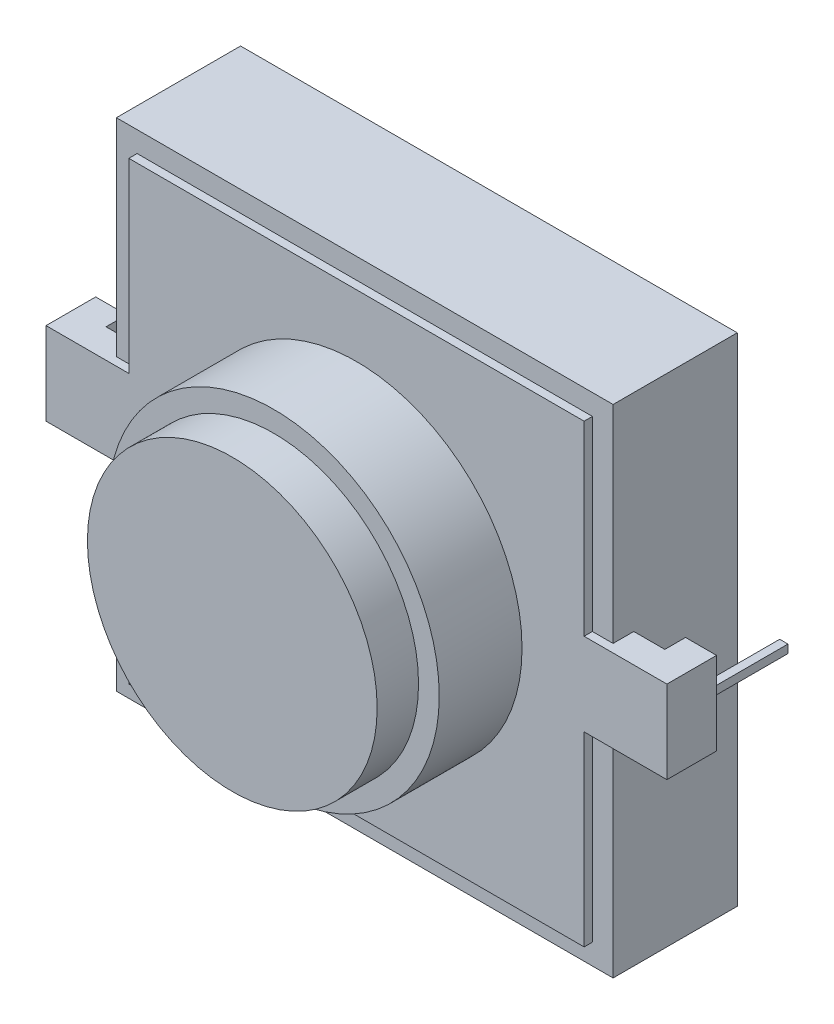
ISO-10303-21;
HEADER;
FILE_DESCRIPTION(('STEP AP214'),'2;1');
FILE_NAME('part.step','',(''),(''),'','','');
FILE_SCHEMA(('AUTOMOTIVE_DESIGN { 1 0 10303 214 1 1 1 1 }'));
ENDSEC;
DATA;
#1=APPLICATION_CONTEXT('core data for automotive mechanical design processes');
#2=APPLICATION_PROTOCOL_DEFINITION('international standard','automotive_design',2000,#1);
#3=PRODUCT_CONTEXT('',#1,'mechanical');
#4=PRODUCT('Part','Part','',(#3));
#5=PRODUCT_RELATED_PRODUCT_CATEGORY('part','',(#4));
#6=PRODUCT_DEFINITION_FORMATION('','',#4);
#7=PRODUCT_DEFINITION_CONTEXT('part definition',#1,'design');
#8=PRODUCT_DEFINITION('design','',#6,#7);
#9=PRODUCT_DEFINITION_SHAPE('','',#8);
#10=(LENGTH_UNIT() NAMED_UNIT(*) SI_UNIT(.MILLI.,.METRE.));
#11=(NAMED_UNIT(*) PLANE_ANGLE_UNIT() SI_UNIT($,.RADIAN.));
#12=(NAMED_UNIT(*) SI_UNIT($,.STERADIAN.) SOLID_ANGLE_UNIT());
#13=UNCERTAINTY_MEASURE_WITH_UNIT(LENGTH_MEASURE(1.E-05),#10,'distance_accuracy_value','');
#14=(GEOMETRIC_REPRESENTATION_CONTEXT(3) GLOBAL_UNCERTAINTY_ASSIGNED_CONTEXT((#13)) GLOBAL_UNIT_ASSIGNED_CONTEXT((#10,
#11,#12)) REPRESENTATION_CONTEXT('',''));
#15=CARTESIAN_POINT('',(0.,0.,0.));
#16=DIRECTION('',(0.,0.,1.));
#17=DIRECTION('',(1.,0.,0.));
#18=AXIS2_PLACEMENT_3D('',#15,#16,#17);
#19=CARTESIAN_POINT('',(-6.75,1.,2.));
#20=DIRECTION('',(0.,0.,1.));
#21=DIRECTION('',(1.,0.,0.));
#22=AXIS2_PLACEMENT_3D('',#19,#20,#21);
#23=PLANE('',#22);
#24=DIRECTION('',(-1.,0.,0.));
#25=VECTOR('',#24,1.);
#26=CARTESIAN_POINT('',(-6.75,-1.,2.));
#27=LINE('',#26,#25);
#28=CARTESIAN_POINT('',(-6.75,-1.,2.));
#29=VERTEX_POINT('',#28);
#30=CARTESIAN_POINT('',(-7.5,-1.,2.));
#31=VERTEX_POINT('',#30);
#32=EDGE_CURVE('E314',#29,#31,#27,.T.);
#33=ORIENTED_EDGE('',*,*,#32,.T.);
#34=DIRECTION('',(0.,-1.,0.));
#35=VECTOR('',#34,1.);
#36=CARTESIAN_POINT('',(-7.5,1.,2.));
#37=LINE('',#36,#35);
#38=CARTESIAN_POINT('',(-7.5,1.,2.));
#39=VERTEX_POINT('',#38);
#40=EDGE_CURVE('E321',#39,#31,#37,.T.);
#41=ORIENTED_EDGE('',*,*,#40,.F.);
#42=DIRECTION('',(-1.,0.,0.));
#43=VECTOR('',#42,1.);
#44=CARTESIAN_POINT('',(-6.75,1.,2.));
#45=LINE('',#44,#43);
#46=CARTESIAN_POINT('',(-6.75,1.,2.));
#47=VERTEX_POINT('',#46);
#48=EDGE_CURVE('E318',#47,#39,#45,.T.);
#49=ORIENTED_EDGE('',*,*,#48,.F.);
#50=DIRECTION('',(0.,-1.,0.));
#51=VECTOR('',#50,1.);
#52=CARTESIAN_POINT('',(-6.75,1.,2.));
#53=LINE('',#52,#51);
#54=EDGE_CURVE('E332',#47,#29,#53,.T.);
#55=ORIENTED_EDGE('',*,*,#54,.T.);
#56=EDGE_LOOP('',(#33,#41,#49,#55));
#57=FACE_BOUND('',#56,.T.);
#58=DIRECTION('',(1.,0.,0.));
#59=VECTOR('',#58,1.);
#60=CARTESIAN_POINT('',(-7.225,0.1,2.));
#61=LINE('',#60,#59);
#62=CARTESIAN_POINT('',(-7.225,0.1,2.));
#63=VERTEX_POINT('',#62);
#64=CARTESIAN_POINT('',(-7.025,0.1,2.));
#65=VERTEX_POINT('',#64);
#66=EDGE_CURVE('E246',#63,#65,#61,.T.);
#67=ORIENTED_EDGE('',*,*,#66,.F.);
#68=DIRECTION('',(0.,-1.,0.));
#69=VECTOR('',#68,1.);
#70=CARTESIAN_POINT('',(-7.225,0.1,2.));
#71=LINE('',#70,#69);
#72=CARTESIAN_POINT('',(-7.225,-0.1,2.));
#73=VERTEX_POINT('',#72);
#74=EDGE_CURVE('E257',#63,#73,#71,.T.);
#75=ORIENTED_EDGE('',*,*,#74,.T.);
#76=DIRECTION('',(1.,0.,0.));
#77=VECTOR('',#76,1.);
#78=CARTESIAN_POINT('',(-7.225,-0.1,2.));
#79=LINE('',#78,#77);
#80=CARTESIAN_POINT('',(-7.025,-0.1,2.));
#81=VERTEX_POINT('',#80);
#82=EDGE_CURVE('E274',#73,#81,#79,.T.);
#83=ORIENTED_EDGE('',*,*,#82,.T.);
#84=DIRECTION('',(0.,-1.,0.));
#85=VECTOR('',#84,1.);
#86=CARTESIAN_POINT('',(-7.025,0.1,2.));
#87=LINE('',#86,#85);
#88=EDGE_CURVE('E264',#65,#81,#87,.T.);
#89=ORIENTED_EDGE('',*,*,#88,.F.);
#90=EDGE_LOOP('',(#67,#75,#83,#89));
#91=FACE_BOUND('',#90,.T.);
#92=ADVANCED_FACE('F32',(#57,#91),#23,.F.);
#93=CARTESIAN_POINT('',(6.,6.,3.));
#94=DIRECTION('',(-1.,0.,0.));
#95=DIRECTION('',(0.,-1.,0.));
#96=AXIS2_PLACEMENT_3D('',#93,#94,#95);
#97=PLANE('',#96);
#98=DIRECTION('',(0.,0.,1.));
#99=VECTOR('',#98,1.);
#100=CARTESIAN_POINT('',(6.,1.,3.));
#101=LINE('',#100,#99);
#102=CARTESIAN_POINT('',(6.,1.,2.5));
#103=VERTEX_POINT('',#102);
#104=CARTESIAN_POINT('',(6.,1.,3.));
#105=VERTEX_POINT('',#104);
#106=EDGE_CURVE('E348',#103,#105,#101,.T.);
#107=ORIENTED_EDGE('',*,*,#106,.F.);
#108=DIRECTION('',(0.,-1.,0.));
#109=VECTOR('',#108,1.);
#110=CARTESIAN_POINT('',(6.,1.,2.5));
#111=LINE('',#110,#109);
#112=CARTESIAN_POINT('',(6.,-1.,2.5));
#113=VERTEX_POINT('',#112);
#114=EDGE_CURVE('E350',#103,#113,#111,.T.);
#115=ORIENTED_EDGE('',*,*,#114,.T.);
#116=DIRECTION('',(0.,0.,1.));
#117=VECTOR('',#116,1.);
#118=CARTESIAN_POINT('',(6.,-1.,3.));
#119=LINE('',#118,#117);
#120=CARTESIAN_POINT('',(6.,-1.,3.));
#121=VERTEX_POINT('',#120);
#122=EDGE_CURVE('E344',#113,#121,#119,.T.);
#123=ORIENTED_EDGE('',*,*,#122,.T.);
#124=DIRECTION('',(0.,1.,0.));
#125=VECTOR('',#124,1.);
#126=CARTESIAN_POINT('',(6.,6.,3.));
#127=LINE('',#126,#125);
#128=CARTESIAN_POINT('',(6.,-6.,3.));
#129=VERTEX_POINT('',#128);
#130=EDGE_CURVE('E455',#129,#121,#127,.T.);
#131=ORIENTED_EDGE('',*,*,#130,.F.);
#132=DIRECTION('',(0.,0.,-1.));
#133=VECTOR('',#132,1.);
#134=CARTESIAN_POINT('',(6.,-6.,3.));
#135=LINE('',#134,#133);
#136=CARTESIAN_POINT('',(6.,-6.,0.));
#137=VERTEX_POINT('',#136);
#138=EDGE_CURVE('E467',#129,#137,#135,.T.);
#139=ORIENTED_EDGE('',*,*,#138,.T.);
#140=DIRECTION('',(0.,1.,0.));
#141=VECTOR('',#140,1.);
#142=CARTESIAN_POINT('',(6.,6.,0.));
#143=LINE('',#142,#141);
#144=CARTESIAN_POINT('',(6.,6.,0.));
#145=VERTEX_POINT('',#144);
#146=EDGE_CURVE('E454',#137,#145,#143,.T.);
#147=ORIENTED_EDGE('',*,*,#146,.T.);
#148=DIRECTION('',(0.,0.,-1.));
#149=VECTOR('',#148,1.);
#150=CARTESIAN_POINT('',(6.,6.,3.));
#151=LINE('',#150,#149);
#152=CARTESIAN_POINT('',(6.,6.,3.));
#153=VERTEX_POINT('',#152);
#154=EDGE_CURVE('E36',#153,#145,#151,.T.);
#155=ORIENTED_EDGE('',*,*,#154,.F.);
#156=EDGE_CURVE('E459',#105,#153,#127,.T.);
#157=ORIENTED_EDGE('',*,*,#156,.F.);
#158=EDGE_LOOP('',(#107,#115,#123,#131,#139,#147,#155,#157));
#159=FACE_BOUND('',#158,.T.);
#160=ADVANCED_FACE('F34',(#159),#97,.F.);
#161=CARTESIAN_POINT('',(0.,0.,3.));
#162=DIRECTION('',(0.,0.,1.));
#163=DIRECTION('',(1.,0.,0.));
#164=AXIS2_PLACEMENT_3D('',#161,#162,#163);
#165=PLANE('',#164);
#166=DIRECTION('',(1.,0.,0.));
#167=VECTOR('',#166,1.);
#168=CARTESIAN_POINT('',(5.5,-1.,3.));
#169=LINE('',#168,#167);
#170=CARTESIAN_POINT('',(5.5,-1.,3.));
#171=VERTEX_POINT('',#170);
#172=EDGE_CURVE('E416',#171,#121,#169,.T.);
#173=ORIENTED_EDGE('',*,*,#172,.F.);
#174=DIRECTION('',(0.,1.,0.));
#175=VECTOR('',#174,1.);
#176=CARTESIAN_POINT('',(5.5,-1.,3.));
#177=LINE('',#176,#175);
#178=CARTESIAN_POINT('',(5.50000000000001,-5.5,3.));
#179=VERTEX_POINT('',#178);
#180=EDGE_CURVE('E413',#179,#171,#177,.T.);
#181=ORIENTED_EDGE('',*,*,#180,.F.);
#182=DIRECTION('',(1.,0.,0.));
#183=VECTOR('',#182,1.);
#184=CARTESIAN_POINT('',(-5.5,-5.5,3.));
#185=LINE('',#184,#183);
#186=CARTESIAN_POINT('',(-5.5,-5.5,3.));
#187=VERTEX_POINT('',#186);
#188=EDGE_CURVE('E410',#187,#179,#185,.T.);
#189=ORIENTED_EDGE('',*,*,#188,.F.);
#190=DIRECTION('',(0.,-1.,0.));
#191=VECTOR('',#190,1.);
#192=CARTESIAN_POINT('',(-5.5,-5.5,3.));
#193=LINE('',#192,#191);
#194=CARTESIAN_POINT('',(-5.5,-1.,3.));
#195=VERTEX_POINT('',#194);
#196=EDGE_CURVE('E404',#195,#187,#193,.T.);
#197=ORIENTED_EDGE('',*,*,#196,.F.);
#198=DIRECTION('',(1.,0.,0.));
#199=VECTOR('',#198,1.);
#200=CARTESIAN_POINT('',(-5.5,-1.,3.));
#201=LINE('',#200,#199);
#202=CARTESIAN_POINT('',(-6.,-1.,3.));
#203=VERTEX_POINT('',#202);
#204=EDGE_CURVE('E41',#203,#195,#201,.T.);
#205=ORIENTED_EDGE('',*,*,#204,.F.);
#206=DIRECTION('',(0.,-1.,0.));
#207=VECTOR('',#206,1.);
#208=CARTESIAN_POINT('',(-6.,6.,3.));
#209=LINE('',#208,#207);
#210=CARTESIAN_POINT('',(-6.,-6.,3.));
#211=VERTEX_POINT('',#210);
#212=EDGE_CURVE('E461',#203,#211,#209,.T.);
#213=ORIENTED_EDGE('',*,*,#212,.T.);
#214=DIRECTION('',(1.,0.,0.));
#215=VECTOR('',#214,1.);
#216=CARTESIAN_POINT('',(-6.,-6.,3.));
#217=LINE('',#216,#215);
#218=EDGE_CURVE('E465',#211,#129,#217,.T.);
#219=ORIENTED_EDGE('',*,*,#218,.T.);
#220=ORIENTED_EDGE('',*,*,#130,.T.);
#221=EDGE_LOOP('',(#173,#181,#189,#197,#205,#213,#219,#220));
#222=FACE_BOUND('',#221,.T.);
#223=ADVANCED_FACE('F508',(#222),#165,.T.);
#224=CARTESIAN_POINT('',(-6.,6.,3.));
#225=DIRECTION('',(0.,-1.,0.));
#226=DIRECTION('',(0.,0.,-1.));
#227=AXIS2_PLACEMENT_3D('',#224,#225,#226);
#228=PLANE('',#227);
#229=DIRECTION('',(-1.,0.,0.));
#230=VECTOR('',#229,1.);
#231=CARTESIAN_POINT('',(-6.,6.,0.));
#232=LINE('',#231,#230);
#233=CARTESIAN_POINT('',(-6.,6.,0.));
#234=VERTEX_POINT('',#233);
#235=EDGE_CURVE('E470',#145,#234,#232,.T.);
#236=ORIENTED_EDGE('',*,*,#235,.T.);
#237=DIRECTION('',(0.,0.,-1.));
#238=VECTOR('',#237,1.);
#239=CARTESIAN_POINT('',(-6.,6.,3.));
#240=LINE('',#239,#238);
#241=CARTESIAN_POINT('',(-6.,6.,3.));
#242=VERTEX_POINT('',#241);
#243=EDGE_CURVE('E480',#242,#234,#240,.T.);
#244=ORIENTED_EDGE('',*,*,#243,.F.);
#245=DIRECTION('',(-1.,0.,0.));
#246=VECTOR('',#245,1.);
#247=CARTESIAN_POINT('',(-6.,6.,3.));
#248=LINE('',#247,#246);
#249=EDGE_CURVE('E458',#153,#242,#248,.T.);
#250=ORIENTED_EDGE('',*,*,#249,.F.);
#251=ORIENTED_EDGE('',*,*,#154,.T.);
#252=EDGE_LOOP('',(#236,#244,#250,#251));
#253=FACE_BOUND('',#252,.T.);
#254=ADVANCED_FACE('F490',(#253),#228,.F.);
#255=CARTESIAN_POINT('',(-6.,6.,3.));
#256=DIRECTION('',(1.,0.,0.));
#257=DIRECTION('',(0.,1.,0.));
#258=AXIS2_PLACEMENT_3D('',#255,#256,#257);
#259=PLANE('',#258);
#260=DIRECTION('',(0.,-1.,0.));
#261=VECTOR('',#260,1.);
#262=CARTESIAN_POINT('',(-6.,1.,2.5));
#263=LINE('',#262,#261);
#264=CARTESIAN_POINT('',(-6.,1.,2.5));
#265=VERTEX_POINT('',#264);
#266=CARTESIAN_POINT('',(-6.,-1.,2.5));
#267=VERTEX_POINT('',#266);
#268=EDGE_CURVE('E338',#265,#267,#263,.T.);
#269=ORIENTED_EDGE('',*,*,#268,.F.);
#270=DIRECTION('',(0.,0.,-1.));
#271=VECTOR('',#270,1.);
#272=CARTESIAN_POINT('',(-6.,1.,3.));
#273=LINE('',#272,#271);
#274=CARTESIAN_POINT('',(-6.,1.,3.));
#275=VERTEX_POINT('',#274);
#276=EDGE_CURVE('E311',#275,#265,#273,.T.);
#277=ORIENTED_EDGE('',*,*,#276,.F.);
#278=EDGE_CURVE('E462',#242,#275,#209,.T.);
#279=ORIENTED_EDGE('',*,*,#278,.F.);
#280=ORIENTED_EDGE('',*,*,#243,.T.);
#281=DIRECTION('',(0.,-1.,0.));
#282=VECTOR('',#281,1.);
#283=CARTESIAN_POINT('',(-6.,6.,0.));
#284=LINE('',#283,#282);
#285=CARTESIAN_POINT('',(-6.,-6.,0.));
#286=VERTEX_POINT('',#285);
#287=EDGE_CURVE('E472',#234,#286,#284,.T.);
#288=ORIENTED_EDGE('',*,*,#287,.T.);
#289=DIRECTION('',(0.,0.,-1.));
#290=VECTOR('',#289,1.);
#291=CARTESIAN_POINT('',(-6.,-6.,3.));
#292=LINE('',#291,#290);
#293=EDGE_CURVE('E478',#211,#286,#292,.T.);
#294=ORIENTED_EDGE('',*,*,#293,.F.);
#295=ORIENTED_EDGE('',*,*,#212,.F.);
#296=DIRECTION('',(0.,0.,-1.));
#297=VECTOR('',#296,1.);
#298=CARTESIAN_POINT('',(-6.,-1.,3.));
#299=LINE('',#298,#297);
#300=EDGE_CURVE('E310',#203,#267,#299,.T.);
#301=ORIENTED_EDGE('',*,*,#300,.T.);
#302=EDGE_LOOP('',(#269,#277,#279,#280,#288,#294,#295,#301));
#303=FACE_BOUND('',#302,.T.);
#304=ADVANCED_FACE('F502',(#303),#259,.F.);
#305=CARTESIAN_POINT('',(-6.,-6.,3.));
#306=DIRECTION('',(0.,1.,0.));
#307=DIRECTION('',(0.,0.,1.));
#308=AXIS2_PLACEMENT_3D('',#305,#306,#307);
#309=PLANE('',#308);
#310=DIRECTION('',(1.,0.,0.));
#311=VECTOR('',#310,1.);
#312=CARTESIAN_POINT('',(-6.,-6.,0.));
#313=LINE('',#312,#311);
#314=EDGE_CURVE('E474',#286,#137,#313,.T.);
#315=ORIENTED_EDGE('',*,*,#314,.T.);
#316=ORIENTED_EDGE('',*,*,#138,.F.);
#317=ORIENTED_EDGE('',*,*,#218,.F.);
#318=ORIENTED_EDGE('',*,*,#293,.T.);
#319=EDGE_LOOP('',(#315,#316,#317,#318));
#320=FACE_BOUND('',#319,.T.);
#321=ADVANCED_FACE('F506',(#320),#309,.F.);
#322=DIRECTION('',(-1.,0.,0.));
#323=VECTOR('',#322,1.);
#324=CARTESIAN_POINT('',(5.5,1.,3.));
#325=LINE('',#324,#323);
#326=CARTESIAN_POINT('',(5.5,1.,3.));
#327=VERTEX_POINT('',#326);
#328=EDGE_CURVE('E407',#105,#327,#325,.T.);
#329=ORIENTED_EDGE('',*,*,#328,.F.);
#330=ORIENTED_EDGE('',*,*,#156,.T.);
#331=ORIENTED_EDGE('',*,*,#249,.T.);
#332=ORIENTED_EDGE('',*,*,#278,.T.);
#333=DIRECTION('',(-1.,0.,0.));
#334=VECTOR('',#333,1.);
#335=CARTESIAN_POINT('',(-5.5,1.,3.));
#336=LINE('',#335,#334);
#337=CARTESIAN_POINT('',(-5.5,1.,3.));
#338=VERTEX_POINT('',#337);
#339=EDGE_CURVE('E401',#338,#275,#336,.T.);
#340=ORIENTED_EDGE('',*,*,#339,.F.);
#341=DIRECTION('',(0.,-1.,0.));
#342=VECTOR('',#341,1.);
#343=CARTESIAN_POINT('',(-5.5,1.,3.));
#344=LINE('',#343,#342);
#345=CARTESIAN_POINT('',(-5.5,5.5,3.));
#346=VERTEX_POINT('',#345);
#347=EDGE_CURVE('E398',#346,#338,#344,.T.);
#348=ORIENTED_EDGE('',*,*,#347,.F.);
#349=DIRECTION('',(-1.,0.,0.));
#350=VECTOR('',#349,1.);
#351=CARTESIAN_POINT('',(-5.5,5.5,3.));
#352=LINE('',#351,#350);
#353=CARTESIAN_POINT('',(5.5,5.5,3.));
#354=VERTEX_POINT('',#353);
#355=EDGE_CURVE('E368',#354,#346,#352,.T.);
#356=ORIENTED_EDGE('',*,*,#355,.F.);
#357=DIRECTION('',(0.,1.,0.));
#358=VECTOR('',#357,1.);
#359=CARTESIAN_POINT('',(5.5,5.5,3.));
#360=LINE('',#359,#358);
#361=EDGE_CURVE('E373',#327,#354,#360,.T.);
#362=ORIENTED_EDGE('',*,*,#361,.F.);
#363=EDGE_LOOP('',(#329,#330,#331,#332,#340,#348,#356,#362));
#364=FACE_BOUND('',#363,.T.);
#365=ADVANCED_FACE('F531',(#364),#165,.T.);
#366=CARTESIAN_POINT('',(0.,0.,0.));
#367=DIRECTION('',(0.,0.,1.));
#368=DIRECTION('',(1.,0.,0.));
#369=AXIS2_PLACEMENT_3D('',#366,#367,#368);
#370=PLANE('',#369);
#371=ORIENTED_EDGE('',*,*,#146,.F.);
#372=ORIENTED_EDGE('',*,*,#314,.F.);
#373=ORIENTED_EDGE('',*,*,#287,.F.);
#374=ORIENTED_EDGE('',*,*,#235,.F.);
#375=EDGE_LOOP('',(#371,#372,#373,#374));
#376=FACE_BOUND('',#375,.T.);
#377=ADVANCED_FACE('F499',(#376),#370,.F.);
#378=CARTESIAN_POINT('',(-5.5,5.5,3.2));
#379=DIRECTION('',(0.,-1.,0.));
#380=DIRECTION('',(1.,0.,0.));
#381=AXIS2_PLACEMENT_3D('',#378,#379,#380);
#382=PLANE('',#381);
#383=ORIENTED_EDGE('',*,*,#355,.T.);
#384=DIRECTION('',(0.,0.,-1.));
#385=VECTOR('',#384,1.);
#386=CARTESIAN_POINT('',(-5.5,5.5,3.2));
#387=LINE('',#386,#385);
#388=CARTESIAN_POINT('',(-5.5,5.5,3.2));
#389=VERTEX_POINT('',#388);
#390=EDGE_CURVE('E451',#389,#346,#387,.T.);
#391=ORIENTED_EDGE('',*,*,#390,.F.);
#392=DIRECTION('',(-1.,0.,0.));
#393=VECTOR('',#392,1.);
#394=CARTESIAN_POINT('',(-5.5,5.5,3.2));
#395=LINE('',#394,#393);
#396=CARTESIAN_POINT('',(5.5,5.5,3.2));
#397=VERTEX_POINT('',#396);
#398=EDGE_CURVE('E369',#397,#389,#395,.T.);
#399=ORIENTED_EDGE('',*,*,#398,.F.);
#400=DIRECTION('',(0.,0.,-1.));
#401=VECTOR('',#400,1.);
#402=CARTESIAN_POINT('',(5.5,5.5,3.2));
#403=LINE('',#402,#401);
#404=EDGE_CURVE('E395',#397,#354,#403,.T.);
#405=ORIENTED_EDGE('',*,*,#404,.T.);
#406=EDGE_LOOP('',(#383,#391,#399,#405));
#407=FACE_BOUND('',#406,.T.);
#408=ADVANCED_FACE('F620',(#407),#382,.F.);
#409=CARTESIAN_POINT('',(-5.5,1.,3.2));
#410=DIRECTION('',(1.,0.,0.));
#411=DIRECTION('',(0.,1.,0.));
#412=AXIS2_PLACEMENT_3D('',#409,#410,#411);
#413=PLANE('',#412);
#414=ORIENTED_EDGE('',*,*,#347,.T.);
#415=DIRECTION('',(0.,0.,-1.));
#416=VECTOR('',#415,1.);
#417=CARTESIAN_POINT('',(-5.5,1.,3.2));
#418=LINE('',#417,#416);
#419=CARTESIAN_POINT('',(-5.5,1.,3.2));
#420=VERTEX_POINT('',#419);
#421=EDGE_CURVE('E448',#420,#338,#418,.T.);
#422=ORIENTED_EDGE('',*,*,#421,.F.);
#423=DIRECTION('',(0.,-1.,0.));
#424=VECTOR('',#423,1.);
#425=CARTESIAN_POINT('',(-5.5,1.,3.2));
#426=LINE('',#425,#424);
#427=EDGE_CURVE('E372',#389,#420,#426,.T.);
#428=ORIENTED_EDGE('',*,*,#427,.F.);
#429=ORIENTED_EDGE('',*,*,#390,.T.);
#430=EDGE_LOOP('',(#414,#422,#428,#429));
#431=FACE_BOUND('',#430,.T.);
#432=ADVANCED_FACE('F617',(#431),#413,.F.);
#433=CARTESIAN_POINT('',(-5.5,1.,3.2));
#434=DIRECTION('',(0.,-1.,0.));
#435=DIRECTION('',(0.,0.,-1.));
#436=AXIS2_PLACEMENT_3D('',#433,#434,#435);
#437=PLANE('',#436);
#438=ORIENTED_EDGE('',*,*,#339,.T.);
#439=ORIENTED_EDGE('',*,*,#276,.T.);
#440=DIRECTION('',(-1.,0.,0.));
#441=VECTOR('',#440,1.);
#442=CARTESIAN_POINT('',(-6.,1.,2.5));
#443=LINE('',#442,#441);
#444=CARTESIAN_POINT('',(-6.75,1.,2.5));
#445=VERTEX_POINT('',#444);
#446=EDGE_CURVE('E313',#265,#445,#443,.T.);
#447=ORIENTED_EDGE('',*,*,#446,.T.);
#448=DIRECTION('',(0.,0.,-1.));
#449=VECTOR('',#448,1.);
#450=CARTESIAN_POINT('',(-6.75,1.,2.5));
#451=LINE('',#450,#449);
#452=EDGE_CURVE('E316',#445,#47,#451,.T.);
#453=ORIENTED_EDGE('',*,*,#452,.T.);
#454=ORIENTED_EDGE('',*,*,#48,.T.);
#455=DIRECTION('',(0.,0.,-1.));
#456=VECTOR('',#455,1.);
#457=CARTESIAN_POINT('',(-7.5,1.,3.2));
#458=LINE('',#457,#456);
#459=CARTESIAN_POINT('',(-7.5,1.,3.2));
#460=VERTEX_POINT('',#459);
#461=EDGE_CURVE('E446',#460,#39,#458,.T.);
#462=ORIENTED_EDGE('',*,*,#461,.F.);
#463=DIRECTION('',(-1.,0.,0.));
#464=VECTOR('',#463,1.);
#465=CARTESIAN_POINT('',(-5.5,1.,3.2));
#466=LINE('',#465,#464);
#467=EDGE_CURVE('E375',#420,#460,#466,.T.);
#468=ORIENTED_EDGE('',*,*,#467,.F.);
#469=ORIENTED_EDGE('',*,*,#421,.T.);
#470=EDGE_LOOP('',(#438,#439,#447,#453,#454,#462,#468,#469));
#471=FACE_BOUND('',#470,.T.);
#472=ADVANCED_FACE('F526',(#471),#437,.F.);
#473=CARTESIAN_POINT('',(-7.5,1.,3.2));
#474=DIRECTION('',(1.,0.,0.));
#475=DIRECTION('',(0.,0.,-1.));
#476=AXIS2_PLACEMENT_3D('',#473,#474,#475);
#477=PLANE('',#476);
#478=ORIENTED_EDGE('',*,*,#461,.T.);
#479=ORIENTED_EDGE('',*,*,#40,.T.);
#480=DIRECTION('',(0.,0.,-1.));
#481=VECTOR('',#480,1.);
#482=CARTESIAN_POINT('',(-7.5,-1.,3.2));
#483=LINE('',#482,#481);
#484=CARTESIAN_POINT('',(-7.5,-1.,3.2));
#485=VERTEX_POINT('',#484);
#486=EDGE_CURVE('E444',#485,#31,#483,.T.);
#487=ORIENTED_EDGE('',*,*,#486,.F.);
#488=DIRECTION('',(0.,-1.,0.));
#489=VECTOR('',#488,1.);
#490=CARTESIAN_POINT('',(-7.5,1.,3.2));
#491=LINE('',#490,#489);
#492=EDGE_CURVE('E377',#460,#485,#491,.T.);
#493=ORIENTED_EDGE('',*,*,#492,.F.);
#494=EDGE_LOOP('',(#478,#479,#487,#493));
#495=FACE_BOUND('',#494,.T.);
#496=ADVANCED_FACE('F566',(#495),#477,.F.);
#497=CARTESIAN_POINT('',(-5.5,-1.,3.2));
#498=DIRECTION('',(0.,1.,0.));
#499=DIRECTION('',(0.,0.,1.));
#500=AXIS2_PLACEMENT_3D('',#497,#498,#499);
#501=PLANE('',#500);
#502=ORIENTED_EDGE('',*,*,#486,.T.);
#503=ORIENTED_EDGE('',*,*,#32,.F.);
#504=DIRECTION('',(0.,0.,-1.));
#505=VECTOR('',#504,1.);
#506=CARTESIAN_POINT('',(-6.75,-1.,2.5));
#507=LINE('',#506,#505);
#508=CARTESIAN_POINT('',(-6.75,-1.,2.5));
#509=VERTEX_POINT('',#508);
#510=EDGE_CURVE('E326',#509,#29,#507,.T.);
#511=ORIENTED_EDGE('',*,*,#510,.F.);
#512=DIRECTION('',(-1.,0.,0.));
#513=VECTOR('',#512,1.);
#514=CARTESIAN_POINT('',(-6.,-1.,2.5));
#515=LINE('',#514,#513);
#516=EDGE_CURVE('E324',#267,#509,#515,.T.);
#517=ORIENTED_EDGE('',*,*,#516,.F.);
#518=ORIENTED_EDGE('',*,*,#300,.F.);
#519=ORIENTED_EDGE('',*,*,#204,.T.);
#520=DIRECTION('',(0.,0.,-1.));
#521=VECTOR('',#520,1.);
#522=CARTESIAN_POINT('',(-5.5,-1.,3.2));
#523=LINE('',#522,#521);
#524=CARTESIAN_POINT('',(-5.5,-1.,3.2));
#525=VERTEX_POINT('',#524);
#526=EDGE_CURVE('E441',#525,#195,#523,.T.);
#527=ORIENTED_EDGE('',*,*,#526,.F.);
#528=DIRECTION('',(1.,0.,0.));
#529=VECTOR('',#528,1.);
#530=CARTESIAN_POINT('',(-5.5,-1.,3.2));
#531=LINE('',#530,#529);
#532=EDGE_CURVE('E379',#485,#525,#531,.T.);
#533=ORIENTED_EDGE('',*,*,#532,.F.);
#534=EDGE_LOOP('',(#502,#503,#511,#517,#518,#519,#527,#533));
#535=FACE_BOUND('',#534,.T.);
#536=ADVANCED_FACE('F512',(#535),#501,.F.);
#537=CARTESIAN_POINT('',(-5.5,-5.5,3.2));
#538=DIRECTION('',(1.,0.,0.));
#539=DIRECTION('',(0.,1.,0.));
#540=AXIS2_PLACEMENT_3D('',#537,#538,#539);
#541=PLANE('',#540);
#542=ORIENTED_EDGE('',*,*,#196,.T.);
#543=DIRECTION('',(0.,0.,-1.));
#544=VECTOR('',#543,1.);
#545=CARTESIAN_POINT('',(-5.5,-5.5,3.2));
#546=LINE('',#545,#544);
#547=CARTESIAN_POINT('',(-5.5,-5.5,3.2));
#548=VERTEX_POINT('',#547);
#549=EDGE_CURVE('E438',#548,#187,#546,.T.);
#550=ORIENTED_EDGE('',*,*,#549,.F.);
#551=DIRECTION('',(0.,-1.,0.));
#552=VECTOR('',#551,1.);
#553=CARTESIAN_POINT('',(-5.5,-5.5,3.2));
#554=LINE('',#553,#552);
#555=EDGE_CURVE('E381',#525,#548,#554,.T.);
#556=ORIENTED_EDGE('',*,*,#555,.F.);
#557=ORIENTED_EDGE('',*,*,#526,.T.);
#558=EDGE_LOOP('',(#542,#550,#556,#557));
#559=FACE_BOUND('',#558,.T.);
#560=ADVANCED_FACE('F557',(#559),#541,.F.);
#561=CARTESIAN_POINT('',(-5.5,-5.5,3.2));
#562=DIRECTION('',(0.,1.,0.));
#563=DIRECTION('',(-1.,0.,0.));
#564=AXIS2_PLACEMENT_3D('',#561,#562,#563);
#565=PLANE('',#564);
#566=ORIENTED_EDGE('',*,*,#188,.T.);
#567=DIRECTION('',(0.,0.,-1.));
#568=VECTOR('',#567,1.);
#569=CARTESIAN_POINT('',(5.50000000000001,-5.5,3.2));
#570=LINE('',#569,#568);
#571=CARTESIAN_POINT('',(5.50000000000001,-5.5,3.2));
#572=VERTEX_POINT('',#571);
#573=EDGE_CURVE('E435',#572,#179,#570,.T.);
#574=ORIENTED_EDGE('',*,*,#573,.F.);
#575=DIRECTION('',(1.,0.,0.));
#576=VECTOR('',#575,1.);
#577=CARTESIAN_POINT('',(-5.5,-5.5,3.2));
#578=LINE('',#577,#576);
#579=EDGE_CURVE('E383',#548,#572,#578,.T.);
#580=ORIENTED_EDGE('',*,*,#579,.F.);
#581=ORIENTED_EDGE('',*,*,#549,.T.);
#582=EDGE_LOOP('',(#566,#574,#580,#581));
#583=FACE_BOUND('',#582,.T.);
#584=ADVANCED_FACE('F554',(#583),#565,.F.);
#585=CARTESIAN_POINT('',(5.5,-1.,3.2));
#586=DIRECTION('',(-1.,0.,0.));
#587=DIRECTION('',(0.,-1.,0.));
#588=AXIS2_PLACEMENT_3D('',#585,#586,#587);
#589=PLANE('',#588);
#590=ORIENTED_EDGE('',*,*,#180,.T.);
#591=DIRECTION('',(0.,0.,-1.));
#592=VECTOR('',#591,1.);
#593=CARTESIAN_POINT('',(5.5,-1.,3.2));
#594=LINE('',#593,#592);
#595=CARTESIAN_POINT('',(5.5,-1.,3.2));
#596=VERTEX_POINT('',#595);
#597=EDGE_CURVE('E432',#596,#171,#594,.T.);
#598=ORIENTED_EDGE('',*,*,#597,.F.);
#599=DIRECTION('',(0.,1.,0.));
#600=VECTOR('',#599,1.);
#601=CARTESIAN_POINT('',(5.5,-1.,3.2));
#602=LINE('',#601,#600);
#603=EDGE_CURVE('E385',#572,#596,#602,.T.);
#604=ORIENTED_EDGE('',*,*,#603,.F.);
#605=ORIENTED_EDGE('',*,*,#573,.T.);
#606=EDGE_LOOP('',(#590,#598,#604,#605));
#607=FACE_BOUND('',#606,.T.);
#608=ADVANCED_FACE('F549',(#607),#589,.F.);
#609=CARTESIAN_POINT('',(5.5,-1.,3.2));
#610=DIRECTION('',(0.,1.,0.));
#611=DIRECTION('',(0.,0.,1.));
#612=AXIS2_PLACEMENT_3D('',#609,#610,#611);
#613=PLANE('',#612);
#614=ORIENTED_EDGE('',*,*,#172,.T.);
#615=ORIENTED_EDGE('',*,*,#122,.F.);
#616=DIRECTION('',(-1.,0.,0.));
#617=VECTOR('',#616,1.);
#618=CARTESIAN_POINT('',(6.,-1.,2.5));
#619=LINE('',#618,#617);
#620=CARTESIAN_POINT('',(6.75,-1.,2.5));
#621=VERTEX_POINT('',#620);
#622=EDGE_CURVE('E354',#621,#113,#619,.T.);
#623=ORIENTED_EDGE('',*,*,#622,.F.);
#624=DIRECTION('',(0.,0.,1.));
#625=VECTOR('',#624,1.);
#626=CARTESIAN_POINT('',(6.75,-1.,2.5));
#627=LINE('',#626,#625);
#628=CARTESIAN_POINT('',(6.75,-1.,2.));
#629=VERTEX_POINT('',#628);
#630=EDGE_CURVE('E352',#629,#621,#627,.T.);
#631=ORIENTED_EDGE('',*,*,#630,.F.);
#632=DIRECTION('',(-1.,0.,0.));
#633=VECTOR('',#632,1.);
#634=CARTESIAN_POINT('',(6.75,-1.,2.));
#635=LINE('',#634,#633);
#636=CARTESIAN_POINT('',(7.5,-1.,2.));
#637=VERTEX_POINT('',#636);
#638=EDGE_CURVE('E340',#637,#629,#635,.T.);
#639=ORIENTED_EDGE('',*,*,#638,.F.);
#640=DIRECTION('',(0.,0.,-1.));
#641=VECTOR('',#640,1.);
#642=CARTESIAN_POINT('',(7.5,-1.,3.2));
#643=LINE('',#642,#641);
#644=CARTESIAN_POINT('',(7.5,-1.,3.2));
#645=VERTEX_POINT('',#644);
#646=EDGE_CURVE('E430',#645,#637,#643,.T.);
#647=ORIENTED_EDGE('',*,*,#646,.F.);
#648=DIRECTION('',(1.,0.,0.));
#649=VECTOR('',#648,1.);
#650=CARTESIAN_POINT('',(5.5,-1.,3.2));
#651=LINE('',#650,#649);
#652=EDGE_CURVE('E387',#596,#645,#651,.T.);
#653=ORIENTED_EDGE('',*,*,#652,.F.);
#654=ORIENTED_EDGE('',*,*,#597,.T.);
#655=EDGE_LOOP('',(#614,#615,#623,#631,#639,#647,#653,#654));
#656=FACE_BOUND('',#655,.T.);
#657=ADVANCED_FACE('F545',(#656),#613,.F.);
#658=CARTESIAN_POINT('',(7.5,1.,3.2));
#659=DIRECTION('',(-1.,0.,0.));
#660=DIRECTION('',(0.,0.,1.));
#661=AXIS2_PLACEMENT_3D('',#658,#659,#660);
#662=PLANE('',#661);
#663=ORIENTED_EDGE('',*,*,#646,.T.);
#664=DIRECTION('',(0.,-1.,0.));
#665=VECTOR('',#664,1.);
#666=CARTESIAN_POINT('',(7.5,1.,2.));
#667=LINE('',#666,#665);
#668=CARTESIAN_POINT('',(7.5,1.,2.));
#669=VERTEX_POINT('',#668);
#670=EDGE_CURVE('E365',#669,#637,#667,.T.);
#671=ORIENTED_EDGE('',*,*,#670,.F.);
#672=DIRECTION('',(0.,0.,-1.));
#673=VECTOR('',#672,1.);
#674=CARTESIAN_POINT('',(7.5,1.,3.2));
#675=LINE('',#674,#673);
#676=CARTESIAN_POINT('',(7.5,1.,3.2));
#677=VERTEX_POINT('',#676);
#678=EDGE_CURVE('E428',#677,#669,#675,.T.);
#679=ORIENTED_EDGE('',*,*,#678,.F.);
#680=DIRECTION('',(0.,1.,0.));
#681=VECTOR('',#680,1.);
#682=CARTESIAN_POINT('',(7.5,1.,3.2));
#683=LINE('',#682,#681);
#684=EDGE_CURVE('E389',#645,#677,#683,.T.);
#685=ORIENTED_EDGE('',*,*,#684,.F.);
#686=EDGE_LOOP('',(#663,#671,#679,#685));
#687=FACE_BOUND('',#686,.T.);
#688=ADVANCED_FACE('F599',(#687),#662,.F.);
#689=CARTESIAN_POINT('',(5.5,1.,3.2));
#690=DIRECTION('',(0.,-1.,0.));
#691=DIRECTION('',(0.,0.,-1.));
#692=AXIS2_PLACEMENT_3D('',#689,#690,#691);
#693=PLANE('',#692);
#694=ORIENTED_EDGE('',*,*,#678,.T.);
#695=DIRECTION('',(-1.,0.,0.));
#696=VECTOR('',#695,1.);
#697=CARTESIAN_POINT('',(6.75,1.,2.));
#698=LINE('',#697,#696);
#699=CARTESIAN_POINT('',(6.75,1.,2.));
#700=VERTEX_POINT('',#699);
#701=EDGE_CURVE('E341',#669,#700,#698,.T.);
#702=ORIENTED_EDGE('',*,*,#701,.T.);
#703=DIRECTION('',(0.,0.,1.));
#704=VECTOR('',#703,1.);
#705=CARTESIAN_POINT('',(6.75,1.,2.5));
#706=LINE('',#705,#704);
#707=CARTESIAN_POINT('',(6.75,1.,2.5));
#708=VERTEX_POINT('',#707);
#709=EDGE_CURVE('E343',#700,#708,#706,.T.);
#710=ORIENTED_EDGE('',*,*,#709,.T.);
#711=DIRECTION('',(-1.,0.,0.));
#712=VECTOR('',#711,1.);
#713=CARTESIAN_POINT('',(6.,1.,2.5));
#714=LINE('',#713,#712);
#715=EDGE_CURVE('E346',#708,#103,#714,.T.);
#716=ORIENTED_EDGE('',*,*,#715,.T.);
#717=ORIENTED_EDGE('',*,*,#106,.T.);
#718=ORIENTED_EDGE('',*,*,#328,.T.);
#719=DIRECTION('',(0.,0.,-1.));
#720=VECTOR('',#719,1.);
#721=CARTESIAN_POINT('',(5.5,1.,3.2));
#722=LINE('',#721,#720);
#723=CARTESIAN_POINT('',(5.5,1.,3.2));
#724=VERTEX_POINT('',#723);
#725=EDGE_CURVE('E425',#724,#327,#722,.T.);
#726=ORIENTED_EDGE('',*,*,#725,.F.);
#727=DIRECTION('',(-1.,0.,0.));
#728=VECTOR('',#727,1.);
#729=CARTESIAN_POINT('',(5.5,1.,3.2));
#730=LINE('',#729,#728);
#731=EDGE_CURVE('E391',#677,#724,#730,.T.);
#732=ORIENTED_EDGE('',*,*,#731,.F.);
#733=EDGE_LOOP('',(#694,#702,#710,#716,#717,#718,#726,#732));
#734=FACE_BOUND('',#733,.T.);
#735=ADVANCED_FACE('F534',(#734),#693,.F.);
#736=CARTESIAN_POINT('',(5.5,5.5,3.2));
#737=DIRECTION('',(-1.,0.,0.));
#738=DIRECTION('',(0.,-1.,0.));
#739=AXIS2_PLACEMENT_3D('',#736,#737,#738);
#740=PLANE('',#739);
#741=ORIENTED_EDGE('',*,*,#361,.T.);
#742=ORIENTED_EDGE('',*,*,#404,.F.);
#743=DIRECTION('',(0.,1.,0.));
#744=VECTOR('',#743,1.);
#745=CARTESIAN_POINT('',(5.5,5.5,3.2));
#746=LINE('',#745,#744);
#747=EDGE_CURVE('E393',#724,#397,#746,.T.);
#748=ORIENTED_EDGE('',*,*,#747,.F.);
#749=ORIENTED_EDGE('',*,*,#725,.T.);
#750=EDGE_LOOP('',(#741,#742,#748,#749));
#751=FACE_BOUND('',#750,.T.);
#752=ADVANCED_FACE('F592',(#751),#740,.F.);
#753=CARTESIAN_POINT('',(0.,0.,3.2));
#754=DIRECTION('',(0.,0.,-1.));
#755=DIRECTION('',(-1.,0.,0.));
#756=AXIS2_PLACEMENT_3D('',#753,#754,#755);
#757=PLANE('',#756);
#758=CARTESIAN_POINT('',(0.,0.,3.2));
#759=DIRECTION('',(0.,0.,1.));
#760=DIRECTION('',(1.,0.,0.));
#761=AXIS2_PLACEMENT_3D('',#758,#759,#760);
#762=CIRCLE('',#761,4.);
#763=CARTESIAN_POINT('',(4.,0.,3.2));
#764=VERTEX_POINT('',#763);
#765=EDGE_CURVE('E11',#764,#764,#762,.T.);
#766=ORIENTED_EDGE('',*,*,#765,.F.);
#767=EDGE_LOOP('',(#766));
#768=FACE_BOUND('',#767,.T.);
#769=ORIENTED_EDGE('',*,*,#398,.T.);
#770=ORIENTED_EDGE('',*,*,#427,.T.);
#771=ORIENTED_EDGE('',*,*,#467,.T.);
#772=ORIENTED_EDGE('',*,*,#492,.T.);
#773=ORIENTED_EDGE('',*,*,#532,.T.);
#774=ORIENTED_EDGE('',*,*,#555,.T.);
#775=ORIENTED_EDGE('',*,*,#579,.T.);
#776=ORIENTED_EDGE('',*,*,#603,.T.);
#777=ORIENTED_EDGE('',*,*,#652,.T.);
#778=ORIENTED_EDGE('',*,*,#684,.T.);
#779=ORIENTED_EDGE('',*,*,#731,.T.);
#780=ORIENTED_EDGE('',*,*,#747,.T.);
#781=EDGE_LOOP('',(#769,#770,#771,#772,#773,#774,#775,#776,#777,#778,#779,#780));
#782=FACE_BOUND('',#781,.T.);
#783=ADVANCED_FACE('F562',(#768,#782),#757,.F.);
#784=CARTESIAN_POINT('',(6.75,1.,2.));
#785=DIRECTION('',(0.,0.,1.));
#786=DIRECTION('',(1.,0.,0.));
#787=AXIS2_PLACEMENT_3D('',#784,#785,#786);
#788=PLANE('',#787);
#789=DIRECTION('',(0.,-1.,0.));
#790=VECTOR('',#789,1.);
#791=CARTESIAN_POINT('',(7.225,0.1,2.));
#792=LINE('',#791,#790);
#793=CARTESIAN_POINT('',(7.225,0.0999999999999999,2.));
#794=VERTEX_POINT('',#793);
#795=CARTESIAN_POINT('',(7.225,-0.1,2.));
#796=VERTEX_POINT('',#795);
#797=EDGE_CURVE('E305',#794,#796,#792,.T.);
#798=ORIENTED_EDGE('',*,*,#797,.F.);
#799=DIRECTION('',(1.,0.,0.));
#800=VECTOR('',#799,1.);
#801=CARTESIAN_POINT('',(7.225,0.1,2.));
#802=LINE('',#801,#800);
#803=CARTESIAN_POINT('',(7.025,0.0999999999999999,2.));
#804=VERTEX_POINT('',#803);
#805=EDGE_CURVE('E57',#804,#794,#802,.T.);
#806=ORIENTED_EDGE('',*,*,#805,.F.);
#807=DIRECTION('',(0.,-1.,0.));
#808=VECTOR('',#807,1.);
#809=CARTESIAN_POINT('',(7.025,0.1,2.));
#810=LINE('',#809,#808);
#811=CARTESIAN_POINT('',(7.025,-0.1,2.));
#812=VERTEX_POINT('',#811);
#813=EDGE_CURVE('E308',#804,#812,#810,.T.);
#814=ORIENTED_EDGE('',*,*,#813,.T.);
#815=DIRECTION('',(1.,0.,0.));
#816=VECTOR('',#815,1.);
#817=CARTESIAN_POINT('',(7.225,-0.1,2.));
#818=LINE('',#817,#816);
#819=EDGE_CURVE('E295',#812,#796,#818,.T.);
#820=ORIENTED_EDGE('',*,*,#819,.T.);
#821=EDGE_LOOP('',(#798,#806,#814,#820));
#822=FACE_BOUND('',#821,.T.);
#823=ORIENTED_EDGE('',*,*,#638,.T.);
#824=DIRECTION('',(0.,-1.,0.));
#825=VECTOR('',#824,1.);
#826=CARTESIAN_POINT('',(6.75,1.,2.));
#827=LINE('',#826,#825);
#828=EDGE_CURVE('E362',#700,#629,#827,.T.);
#829=ORIENTED_EDGE('',*,*,#828,.F.);
#830=ORIENTED_EDGE('',*,*,#701,.F.);
#831=ORIENTED_EDGE('',*,*,#670,.T.);
#832=EDGE_LOOP('',(#823,#829,#830,#831));
#833=FACE_BOUND('',#832,.T.);
#834=ADVANCED_FACE('F586',(#822,#833),#788,.F.);
#835=CARTESIAN_POINT('',(6.75,1.,2.5));
#836=DIRECTION('',(1.,0.,0.));
#837=DIRECTION('',(0.,0.,-1.));
#838=AXIS2_PLACEMENT_3D('',#835,#836,#837);
#839=PLANE('',#838);
#840=ORIENTED_EDGE('',*,*,#630,.T.);
#841=DIRECTION('',(0.,-1.,0.));
#842=VECTOR('',#841,1.);
#843=CARTESIAN_POINT('',(6.75,1.,2.5));
#844=LINE('',#843,#842);
#845=EDGE_CURVE('E359',#708,#621,#844,.T.);
#846=ORIENTED_EDGE('',*,*,#845,.F.);
#847=ORIENTED_EDGE('',*,*,#709,.F.);
#848=ORIENTED_EDGE('',*,*,#828,.T.);
#849=EDGE_LOOP('',(#840,#846,#847,#848));
#850=FACE_BOUND('',#849,.T.);
#851=ADVANCED_FACE('F583',(#850),#839,.F.);
#852=CARTESIAN_POINT('',(6.,1.,2.5));
#853=DIRECTION('',(0.,0.,1.));
#854=DIRECTION('',(1.,0.,0.));
#855=AXIS2_PLACEMENT_3D('',#852,#853,#854);
#856=PLANE('',#855);
#857=ORIENTED_EDGE('',*,*,#622,.T.);
#858=ORIENTED_EDGE('',*,*,#114,.F.);
#859=ORIENTED_EDGE('',*,*,#715,.F.);
#860=ORIENTED_EDGE('',*,*,#845,.T.);
#861=EDGE_LOOP('',(#857,#858,#859,#860));
#862=FACE_BOUND('',#861,.T.);
#863=ADVANCED_FACE('F540',(#862),#856,.F.);
#864=CARTESIAN_POINT('',(-6.,1.,2.5));
#865=DIRECTION('',(0.,0.,1.));
#866=DIRECTION('',(1.,0.,0.));
#867=AXIS2_PLACEMENT_3D('',#864,#865,#866);
#868=PLANE('',#867);
#869=ORIENTED_EDGE('',*,*,#516,.T.);
#870=DIRECTION('',(0.,-1.,0.));
#871=VECTOR('',#870,1.);
#872=CARTESIAN_POINT('',(-6.75,1.,2.5));
#873=LINE('',#872,#871);
#874=EDGE_CURVE('E335',#445,#509,#873,.T.);
#875=ORIENTED_EDGE('',*,*,#874,.F.);
#876=ORIENTED_EDGE('',*,*,#446,.F.);
#877=ORIENTED_EDGE('',*,*,#268,.T.);
#878=EDGE_LOOP('',(#869,#875,#876,#877));
#879=FACE_BOUND('',#878,.T.);
#880=ADVANCED_FACE('F518',(#879),#868,.F.);
#881=CARTESIAN_POINT('',(-6.75,1.,2.5));
#882=DIRECTION('',(-1.,0.,0.));
#883=DIRECTION('',(0.,0.,1.));
#884=AXIS2_PLACEMENT_3D('',#881,#882,#883);
#885=PLANE('',#884);
#886=ORIENTED_EDGE('',*,*,#510,.T.);
#887=ORIENTED_EDGE('',*,*,#54,.F.);
#888=ORIENTED_EDGE('',*,*,#452,.F.);
#889=ORIENTED_EDGE('',*,*,#874,.T.);
#890=EDGE_LOOP('',(#886,#887,#888,#889));
#891=FACE_BOUND('',#890,.T.);
#892=ADVANCED_FACE('F522',(#891),#885,.F.);
#893=CARTESIAN_POINT('',(7.025,0.1,2.));
#894=DIRECTION('',(1.,0.,0.));
#895=DIRECTION('',(0.,0.,-1.));
#896=AXIS2_PLACEMENT_3D('',#893,#894,#895);
#897=PLANE('',#896);
#898=DIRECTION('',(0.,0.,1.));
#899=VECTOR('',#898,1.);
#900=CARTESIAN_POINT('',(7.025,-0.1,2.));
#901=LINE('',#900,#899);
#902=CARTESIAN_POINT('',(7.025,-0.1,0.));
#903=VERTEX_POINT('',#902);
#904=EDGE_CURVE('E263',#903,#812,#901,.T.);
#905=ORIENTED_EDGE('',*,*,#904,.T.);
#906=ORIENTED_EDGE('',*,*,#813,.F.);
#907=DIRECTION('',(0.,0.,1.));
#908=VECTOR('',#907,1.);
#909=CARTESIAN_POINT('',(7.025,0.1,2.));
#910=LINE('',#909,#908);
#911=CARTESIAN_POINT('',(7.025,0.1,0.));
#912=VERTEX_POINT('',#911);
#913=EDGE_CURVE('E284',#912,#804,#910,.T.);
#914=ORIENTED_EDGE('',*,*,#913,.F.);
#915=DIRECTION('',(0.,-1.,0.));
#916=VECTOR('',#915,1.);
#917=CARTESIAN_POINT('',(7.025,0.1,0.));
#918=LINE('',#917,#916);
#919=EDGE_CURVE('E292',#912,#903,#918,.T.);
#920=ORIENTED_EDGE('',*,*,#919,.T.);
#921=EDGE_LOOP('',(#905,#906,#914,#920));
#922=FACE_BOUND('',#921,.T.);
#923=ADVANCED_FACE('F575',(#922),#897,.F.);
#924=CARTESIAN_POINT('',(7.225,0.1,2.));
#925=DIRECTION('',(-1.,0.,0.));
#926=DIRECTION('',(0.,0.,1.));
#927=AXIS2_PLACEMENT_3D('',#924,#925,#926);
#928=PLANE('',#927);
#929=DIRECTION('',(0.,0.,-1.));
#930=VECTOR('',#929,1.);
#931=CARTESIAN_POINT('',(7.225,-0.1,2.));
#932=LINE('',#931,#930);
#933=CARTESIAN_POINT('',(7.225,-0.1,0.));
#934=VERTEX_POINT('',#933);
#935=EDGE_CURVE('E297',#796,#934,#932,.T.);
#936=ORIENTED_EDGE('',*,*,#935,.T.);
#937=DIRECTION('',(0.,-1.,0.));
#938=VECTOR('',#937,1.);
#939=CARTESIAN_POINT('',(7.225,0.1,0.));
#940=LINE('',#939,#938);
#941=CARTESIAN_POINT('',(7.225,0.1,0.));
#942=VERTEX_POINT('',#941);
#943=EDGE_CURVE('E302',#942,#934,#940,.T.);
#944=ORIENTED_EDGE('',*,*,#943,.F.);
#945=DIRECTION('',(0.,0.,-1.));
#946=VECTOR('',#945,1.);
#947=CARTESIAN_POINT('',(7.225,0.1,2.));
#948=LINE('',#947,#946);
#949=EDGE_CURVE('E288',#794,#942,#948,.T.);
#950=ORIENTED_EDGE('',*,*,#949,.F.);
#951=ORIENTED_EDGE('',*,*,#797,.T.);
#952=EDGE_LOOP('',(#936,#944,#950,#951));
#953=FACE_BOUND('',#952,.T.);
#954=ADVANCED_FACE('F792',(#953),#928,.F.);
#955=CARTESIAN_POINT('',(7.225,0.1,0.));
#956=DIRECTION('',(0.,0.,1.));
#957=DIRECTION('',(1.,0.,0.));
#958=AXIS2_PLACEMENT_3D('',#955,#956,#957);
#959=PLANE('',#958);
#960=DIRECTION('',(-1.,0.,0.));
#961=VECTOR('',#960,1.);
#962=CARTESIAN_POINT('',(7.225,-0.1,0.));
#963=LINE('',#962,#961);
#964=EDGE_CURVE('E286',#934,#903,#963,.T.);
#965=ORIENTED_EDGE('',*,*,#964,.T.);
#966=ORIENTED_EDGE('',*,*,#919,.F.);
#967=DIRECTION('',(-1.,0.,0.));
#968=VECTOR('',#967,1.);
#969=CARTESIAN_POINT('',(7.225,0.1,0.));
#970=LINE('',#969,#968);
#971=EDGE_CURVE('E290',#942,#912,#970,.T.);
#972=ORIENTED_EDGE('',*,*,#971,.F.);
#973=ORIENTED_EDGE('',*,*,#943,.T.);
#974=EDGE_LOOP('',(#965,#966,#972,#973));
#975=FACE_BOUND('',#974,.T.);
#976=ADVANCED_FACE('F801',(#975),#959,.F.);
#977=CARTESIAN_POINT('',(0.,0.1,0.));
#978=DIRECTION('',(0.,1.,0.));
#979=DIRECTION('',(0.,0.,1.));
#980=AXIS2_PLACEMENT_3D('',#977,#978,#979);
#981=PLANE('',#980);
#982=ORIENTED_EDGE('',*,*,#913,.T.);
#983=ORIENTED_EDGE('',*,*,#805,.T.);
#984=ORIENTED_EDGE('',*,*,#949,.T.);
#985=ORIENTED_EDGE('',*,*,#971,.T.);
#986=EDGE_LOOP('',(#982,#983,#984,#985));
#987=FACE_BOUND('',#986,.T.);
#988=ADVANCED_FACE('F810',(#987),#981,.T.);
#989=CARTESIAN_POINT('',(0.,-0.1,0.));
#990=DIRECTION('',(0.,1.,0.));
#991=DIRECTION('',(0.,0.,1.));
#992=AXIS2_PLACEMENT_3D('',#989,#990,#991);
#993=PLANE('',#992);
#994=ORIENTED_EDGE('',*,*,#904,.F.);
#995=ORIENTED_EDGE('',*,*,#964,.F.);
#996=ORIENTED_EDGE('',*,*,#935,.F.);
#997=ORIENTED_EDGE('',*,*,#819,.F.);
#998=EDGE_LOOP('',(#994,#995,#996,#997));
#999=FACE_BOUND('',#998,.T.);
#1000=ADVANCED_FACE('F820',(#999),#993,.F.);
#1001=CARTESIAN_POINT('',(-7.225,0.1,2.));
#1002=DIRECTION('',(1.,0.,0.));
#1003=DIRECTION('',(0.,0.,-1.));
#1004=AXIS2_PLACEMENT_3D('',#1001,#1002,#1003);
#1005=PLANE('',#1004);
#1006=DIRECTION('',(0.,0.,1.));
#1007=VECTOR('',#1006,1.);
#1008=CARTESIAN_POINT('',(-7.225,-0.1,2.));
#1009=LINE('',#1008,#1007);
#1010=CARTESIAN_POINT('',(-7.225,-0.1,0.));
#1011=VERTEX_POINT('',#1010);
#1012=EDGE_CURVE('E260',#1011,#73,#1009,.T.);
#1013=ORIENTED_EDGE('',*,*,#1012,.T.);
#1014=ORIENTED_EDGE('',*,*,#74,.F.);
#1015=DIRECTION('',(0.,0.,1.));
#1016=VECTOR('',#1015,1.);
#1017=CARTESIAN_POINT('',(-7.225,0.1,2.));
#1018=LINE('',#1017,#1016);
#1019=CARTESIAN_POINT('',(-7.225,0.1,0.));
#1020=VERTEX_POINT('',#1019);
#1021=EDGE_CURVE('E242',#1020,#63,#1018,.T.);
#1022=ORIENTED_EDGE('',*,*,#1021,.F.);
#1023=DIRECTION('',(0.,-1.,0.));
#1024=VECTOR('',#1023,1.);
#1025=CARTESIAN_POINT('',(-7.225,0.1,0.));
#1026=LINE('',#1025,#1024);
#1027=EDGE_CURVE('E272',#1020,#1011,#1026,.T.);
#1028=ORIENTED_EDGE('',*,*,#1027,.T.);
#1029=EDGE_LOOP('',(#1013,#1014,#1022,#1028));
#1030=FACE_BOUND('',#1029,.T.);
#1031=ADVANCED_FACE('F258',(#1030),#1005,.F.);
#1032=CARTESIAN_POINT('',(-7.025,0.1,2.));
#1033=DIRECTION('',(-1.,0.,0.));
#1034=DIRECTION('',(0.,0.,1.));
#1035=AXIS2_PLACEMENT_3D('',#1032,#1033,#1034);
#1036=PLANE('',#1035);
#1037=DIRECTION('',(0.,0.,-1.));
#1038=VECTOR('',#1037,1.);
#1039=CARTESIAN_POINT('',(-7.025,-0.1,2.));
#1040=LINE('',#1039,#1038);
#1041=CARTESIAN_POINT('',(-7.025,-0.1,0.));
#1042=VERTEX_POINT('',#1041);
#1043=EDGE_CURVE('E49',#81,#1042,#1040,.T.);
#1044=ORIENTED_EDGE('',*,*,#1043,.T.);
#1045=DIRECTION('',(0.,-1.,0.));
#1046=VECTOR('',#1045,1.);
#1047=CARTESIAN_POINT('',(-7.025,0.1,0.));
#1048=LINE('',#1047,#1046);
#1049=CARTESIAN_POINT('',(-7.025,0.1,0.));
#1050=VERTEX_POINT('',#1049);
#1051=EDGE_CURVE('E280',#1050,#1042,#1048,.T.);
#1052=ORIENTED_EDGE('',*,*,#1051,.F.);
#1053=DIRECTION('',(0.,0.,-1.));
#1054=VECTOR('',#1053,1.);
#1055=CARTESIAN_POINT('',(-7.025,0.1,2.));
#1056=LINE('',#1055,#1054);
#1057=EDGE_CURVE('E267',#65,#1050,#1056,.T.);
#1058=ORIENTED_EDGE('',*,*,#1057,.F.);
#1059=ORIENTED_EDGE('',*,*,#88,.T.);
#1060=EDGE_LOOP('',(#1044,#1052,#1058,#1059));
#1061=FACE_BOUND('',#1060,.T.);
#1062=ADVANCED_FACE('F839',(#1061),#1036,.F.);
#1063=CARTESIAN_POINT('',(-7.225,0.1,0.));
#1064=DIRECTION('',(0.,0.,1.));
#1065=DIRECTION('',(1.,0.,0.));
#1066=AXIS2_PLACEMENT_3D('',#1063,#1064,#1065);
#1067=PLANE('',#1066);
#1068=DIRECTION('',(-1.,0.,0.));
#1069=VECTOR('',#1068,1.);
#1070=CARTESIAN_POINT('',(-7.225,-0.1,0.));
#1071=LINE('',#1070,#1069);
#1072=EDGE_CURVE('E253',#1042,#1011,#1071,.T.);
#1073=ORIENTED_EDGE('',*,*,#1072,.T.);
#1074=ORIENTED_EDGE('',*,*,#1027,.F.);
#1075=DIRECTION('',(-1.,0.,0.));
#1076=VECTOR('',#1075,1.);
#1077=CARTESIAN_POINT('',(-7.225,0.1,0.));
#1078=LINE('',#1077,#1076);
#1079=EDGE_CURVE('E249',#1050,#1020,#1078,.T.);
#1080=ORIENTED_EDGE('',*,*,#1079,.F.);
#1081=ORIENTED_EDGE('',*,*,#1051,.T.);
#1082=EDGE_LOOP('',(#1073,#1074,#1080,#1081));
#1083=FACE_BOUND('',#1082,.T.);
#1084=ADVANCED_FACE('F848',(#1083),#1067,.F.);
#1085=CARTESIAN_POINT('',(0.,0.1,0.));
#1086=DIRECTION('',(0.,-1.,0.));
#1087=DIRECTION('',(0.,0.,-1.));
#1088=AXIS2_PLACEMENT_3D('',#1085,#1086,#1087);
#1089=PLANE('',#1088);
#1090=ORIENTED_EDGE('',*,*,#1021,.T.);
#1091=ORIENTED_EDGE('',*,*,#66,.T.);
#1092=ORIENTED_EDGE('',*,*,#1057,.T.);
#1093=ORIENTED_EDGE('',*,*,#1079,.T.);
#1094=EDGE_LOOP('',(#1090,#1091,#1092,#1093));
#1095=FACE_BOUND('',#1094,.T.);
#1096=ADVANCED_FACE('F244',(#1095),#1089,.F.);
#1097=CARTESIAN_POINT('',(0.,-0.1,0.));
#1098=DIRECTION('',(0.,-1.,0.));
#1099=DIRECTION('',(0.,0.,-1.));
#1100=AXIS2_PLACEMENT_3D('',#1097,#1098,#1099);
#1101=PLANE('',#1100);
#1102=ORIENTED_EDGE('',*,*,#1012,.F.);
#1103=ORIENTED_EDGE('',*,*,#1072,.F.);
#1104=ORIENTED_EDGE('',*,*,#1043,.F.);
#1105=ORIENTED_EDGE('',*,*,#82,.F.);
#1106=EDGE_LOOP('',(#1102,#1103,#1104,#1105));
#1107=FACE_BOUND('',#1106,.T.);
#1108=ADVANCED_FACE('F867',(#1107),#1101,.T.);
#1109=CARTESIAN_POINT('',(0.,0.,5.2));
#1110=DIRECTION('',(0.,0.,-1.));
#1111=DIRECTION('',(-1.,0.,0.));
#1112=AXIS2_PLACEMENT_3D('',#1109,#1110,#1111);
#1113=CYLINDRICAL_SURFACE('',#1112,4.);
#1114=CARTESIAN_POINT('',(0.,0.,5.2));
#1115=DIRECTION('',(0.,0.,1.));
#1116=DIRECTION('',(1.,0.,0.));
#1117=AXIS2_PLACEMENT_3D('',#1114,#1115,#1116);
#1118=CIRCLE('',#1117,4.);
#1119=CARTESIAN_POINT('',(4.,0.,5.2));
#1120=VERTEX_POINT('',#1119);
#1121=EDGE_CURVE('E275',#1120,#1120,#1118,.T.);
#1122=ORIENTED_EDGE('',*,*,#1121,.F.);
#1123=EDGE_LOOP('',(#1122));
#1124=FACE_BOUND('',#1123,.T.);
#1125=ORIENTED_EDGE('',*,*,#765,.T.);
#1126=EDGE_LOOP('',(#1125));
#1127=FACE_BOUND('',#1126,.T.);
#1128=ADVANCED_FACE('F876',(#1124,#1127),#1113,.T.);
#1129=CARTESIAN_POINT('',(0.,0.,5.2));
#1130=DIRECTION('',(0.,0.,1.));
#1131=DIRECTION('',(1.,0.,0.));
#1132=AXIS2_PLACEMENT_3D('',#1129,#1130,#1131);
#1133=PLANE('',#1132);
#1134=CARTESIAN_POINT('',(0.,0.,5.2));
#1135=DIRECTION('',(0.,0.,1.));
#1136=DIRECTION('',(1.,0.,0.));
#1137=AXIS2_PLACEMENT_3D('',#1134,#1135,#1136);
#1138=CIRCLE('',#1137,3.5);
#1139=CARTESIAN_POINT('',(3.5,0.,5.2));
#1140=VERTEX_POINT('',#1139);
#1141=EDGE_CURVE('E928',#1140,#1140,#1138,.T.);
#1142=ORIENTED_EDGE('',*,*,#1141,.F.);
#1143=EDGE_LOOP('',(#1142));
#1144=FACE_BOUND('',#1143,.T.);
#1145=ORIENTED_EDGE('',*,*,#1121,.T.);
#1146=EDGE_LOOP('',(#1145));
#1147=FACE_BOUND('',#1146,.T.);
#1148=ADVANCED_FACE('F890',(#1144,#1147),#1133,.T.);
#1149=CARTESIAN_POINT('',(0.,0.,6.2));
#1150=DIRECTION('',(0.,0.,-1.));
#1151=DIRECTION('',(-1.,0.,0.));
#1152=AXIS2_PLACEMENT_3D('',#1149,#1150,#1151);
#1153=CYLINDRICAL_SURFACE('',#1152,3.5);
#1154=ORIENTED_EDGE('',*,*,#1141,.T.);
#1155=EDGE_LOOP('',(#1154));
#1156=FACE_BOUND('',#1155,.T.);
#1157=CARTESIAN_POINT('',(0.,0.,6.2));
#1158=DIRECTION('',(0.,0.,1.));
#1159=DIRECTION('',(1.,0.,0.));
#1160=AXIS2_PLACEMENT_3D('',#1157,#1158,#1159);
#1161=CIRCLE('',#1160,3.5);
#1162=CARTESIAN_POINT('',(3.5,0.,6.2));
#1163=VERTEX_POINT('',#1162);
#1164=EDGE_CURVE('E926',#1163,#1163,#1161,.T.);
#1165=ORIENTED_EDGE('',*,*,#1164,.F.);
#1166=EDGE_LOOP('',(#1165));
#1167=FACE_BOUND('',#1166,.T.);
#1168=ADVANCED_FACE('F900',(#1156,#1167),#1153,.T.);
#1169=CARTESIAN_POINT('',(0.,0.,6.2));
#1170=DIRECTION('',(0.,0.,1.));
#1171=DIRECTION('',(1.,0.,0.));
#1172=AXIS2_PLACEMENT_3D('',#1169,#1170,#1171);
#1173=PLANE('',#1172);
#1174=ORIENTED_EDGE('',*,*,#1164,.T.);
#1175=EDGE_LOOP('',(#1174));
#1176=FACE_BOUND('',#1175,.T.);
#1177=ADVANCED_FACE('F910',(#1176),#1173,.T.);
#1178=CLOSED_SHELL('',(#92,#160,#223,#254,#304,#321,#365,#377,#408,#432,#472,#496,#536,#560,
#584,#608,#657,#688,#735,#752,#783,#834,#851,#863,#880,#892,#923,#954,#976,#988,#1000,#1031,
#1062,#1084,#1096,#1108,#1128,#1148,#1168,#1177));
#1179=MANIFOLD_SOLID_BREP('B2',#1178);
#1180=ADVANCED_BREP_SHAPE_REPRESENTATION('',(#18,#1179),#14);
#1181=SHAPE_DEFINITION_REPRESENTATION(#9,#1180);
ENDSEC;
END-ISO-10303-21;
